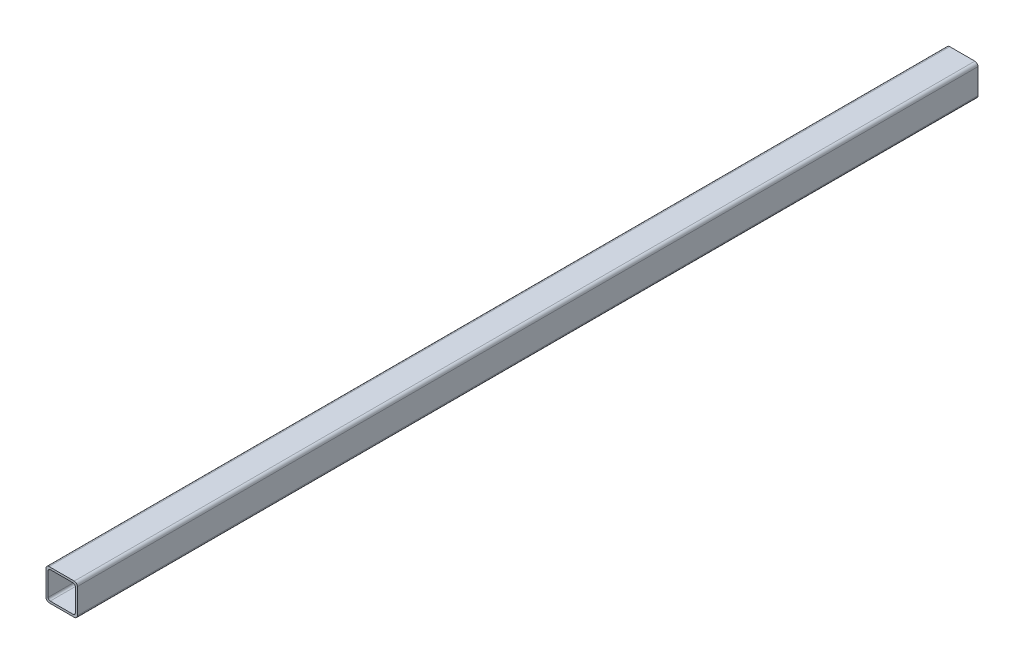
ISO-10303-21;
HEADER;
FILE_DESCRIPTION(('STEP AP214'),'2;1');
FILE_NAME('part.step','',(''),(''),'','','');
FILE_SCHEMA(('AUTOMOTIVE_DESIGN { 1 0 10303 214 1 1 1 1 }'));
ENDSEC;
DATA;
#1=APPLICATION_CONTEXT('core data for automotive mechanical design processes');
#2=APPLICATION_PROTOCOL_DEFINITION('international standard','automotive_design',2000,#1);
#3=PRODUCT_CONTEXT('',#1,'mechanical');
#4=PRODUCT('Part','Part','',(#3));
#5=PRODUCT_RELATED_PRODUCT_CATEGORY('part','',(#4));
#6=PRODUCT_DEFINITION_FORMATION('','',#4);
#7=PRODUCT_DEFINITION_CONTEXT('part definition',#1,'design');
#8=PRODUCT_DEFINITION('design','',#6,#7);
#9=PRODUCT_DEFINITION_SHAPE('','',#8);
#10=(LENGTH_UNIT() NAMED_UNIT(*) SI_UNIT(.MILLI.,.METRE.));
#11=(NAMED_UNIT(*) PLANE_ANGLE_UNIT() SI_UNIT($,.RADIAN.));
#12=(NAMED_UNIT(*) SI_UNIT($,.STERADIAN.) SOLID_ANGLE_UNIT());
#13=UNCERTAINTY_MEASURE_WITH_UNIT(LENGTH_MEASURE(1.E-05),#10,'distance_accuracy_value','');
#14=(GEOMETRIC_REPRESENTATION_CONTEXT(3) GLOBAL_UNCERTAINTY_ASSIGNED_CONTEXT((#13)) GLOBAL_UNIT_ASSIGNED_CONTEXT((#10,
#11,#12)) REPRESENTATION_CONTEXT('',''));
#15=CARTESIAN_POINT('',(0.,0.,0.));
#16=DIRECTION('',(0.,0.,1.));
#17=DIRECTION('',(1.,0.,0.));
#18=AXIS2_PLACEMENT_3D('',#15,#16,#17);
#19=CARTESIAN_POINT('',(-30.,-3.00000000000001,472.426406871193));
#20=DIRECTION('',(1.,0.,0.));
#21=DIRECTION('',(0.,0.,-1.));
#22=AXIS2_PLACEMENT_3D('',#19,#20,#21);
#23=PLANE('',#22);
#24=DIRECTION('',(0.,-1.,0.));
#25=VECTOR('',#24,1.);
#26=CARTESIAN_POINT('',(-30.,-3.00000000000001,430.));
#27=LINE('',#26,#25);
#28=CARTESIAN_POINT('',(-30.,-3.00000000000001,430.));
#29=VERTEX_POINT('',#28);
#30=CARTESIAN_POINT('',(-30.,-27.,430.));
#31=VERTEX_POINT('',#30);
#32=EDGE_CURVE('E196',#29,#31,#27,.T.);
#33=ORIENTED_EDGE('',*,*,#32,.F.);
#34=DIRECTION('',(0.,0.,-1.));
#35=VECTOR('',#34,1.);
#36=CARTESIAN_POINT('',(-30.,-3.00000000000001,472.426406871193));
#37=LINE('',#36,#35);
#38=CARTESIAN_POINT('',(-30.,-3.00000000000001,-430.));
#39=VERTEX_POINT('',#38);
#40=EDGE_CURVE('E49',#29,#39,#37,.T.);
#41=ORIENTED_EDGE('',*,*,#40,.T.);
#42=DIRECTION('',(0.,-1.,0.));
#43=VECTOR('',#42,1.);
#44=CARTESIAN_POINT('',(-30.,-3.00000000000001,-430.));
#45=LINE('',#44,#43);
#46=CARTESIAN_POINT('',(-30.,-27.,-430.));
#47=VERTEX_POINT('',#46);
#48=EDGE_CURVE('E272',#39,#47,#45,.T.);
#49=ORIENTED_EDGE('',*,*,#48,.T.);
#50=DIRECTION('',(0.,0.,-1.));
#51=VECTOR('',#50,1.);
#52=CARTESIAN_POINT('',(-30.,-27.,472.426406871193));
#53=LINE('',#52,#51);
#54=EDGE_CURVE('E232',#31,#47,#53,.T.);
#55=ORIENTED_EDGE('',*,*,#54,.F.);
#56=EDGE_LOOP('',(#33,#41,#49,#55));
#57=FACE_BOUND('',#56,.T.);
#58=ADVANCED_FACE('F34',(#57),#23,.F.);
#59=CARTESIAN_POINT('',(-27.,-2.99999999999999,472.426406871193));
#60=DIRECTION('',(0.,0.,-1.));
#61=DIRECTION('',(-1.,0.,0.));
#62=AXIS2_PLACEMENT_3D('',#59,#60,#61);
#63=CYLINDRICAL_SURFACE('',#62,3.);
#64=CARTESIAN_POINT('',(-27.,-2.99999999999999,430.));
#65=DIRECTION('',(0.,0.,1.));
#66=DIRECTION('',(0.,-1.,0.));
#67=AXIS2_PLACEMENT_3D('',#64,#65,#66);
#68=CIRCLE('',#67,3.);
#69=CARTESIAN_POINT('',(-27.,0.,430.));
#70=VERTEX_POINT('',#69);
#71=EDGE_CURVE('E199',#70,#29,#68,.T.);
#72=ORIENTED_EDGE('',*,*,#71,.F.);
#73=DIRECTION('',(0.,0.,-1.));
#74=VECTOR('',#73,1.);
#75=CARTESIAN_POINT('',(-27.,0.,472.426406871193));
#76=LINE('',#75,#74);
#77=CARTESIAN_POINT('',(-27.,0.,-430.));
#78=VERTEX_POINT('',#77);
#79=EDGE_CURVE('E235',#70,#78,#76,.T.);
#80=ORIENTED_EDGE('',*,*,#79,.T.);
#81=CARTESIAN_POINT('',(-27.,-2.99999999999999,-430.));
#82=DIRECTION('',(0.,0.,1.));
#83=DIRECTION('',(0.,-1.,0.));
#84=AXIS2_PLACEMENT_3D('',#81,#82,#83);
#85=CIRCLE('',#84,3.);
#86=EDGE_CURVE('E270',#78,#39,#85,.T.);
#87=ORIENTED_EDGE('',*,*,#86,.T.);
#88=ORIENTED_EDGE('',*,*,#40,.F.);
#89=EDGE_LOOP('',(#72,#80,#87,#88));
#90=FACE_BOUND('',#89,.T.);
#91=ADVANCED_FACE('F320',(#90),#63,.T.);
#92=CARTESIAN_POINT('',(-27.,0.,472.426406871193));
#93=DIRECTION('',(0.,-1.,0.));
#94=DIRECTION('',(0.,0.,-1.));
#95=AXIS2_PLACEMENT_3D('',#92,#93,#94);
#96=PLANE('',#95);
#97=DIRECTION('',(-1.,0.,0.));
#98=VECTOR('',#97,1.);
#99=CARTESIAN_POINT('',(-27.,0.,430.));
#100=LINE('',#99,#98);
#101=CARTESIAN_POINT('',(-3.00000000000001,0.,430.));
#102=VERTEX_POINT('',#101);
#103=EDGE_CURVE('E202',#102,#70,#100,.T.);
#104=ORIENTED_EDGE('',*,*,#103,.F.);
#105=DIRECTION('',(0.,0.,-1.));
#106=VECTOR('',#105,1.);
#107=CARTESIAN_POINT('',(-3.00000000000001,0.,472.426406871193));
#108=LINE('',#107,#106);
#109=CARTESIAN_POINT('',(-3.00000000000001,0.,-430.));
#110=VERTEX_POINT('',#109);
#111=EDGE_CURVE('E237',#102,#110,#108,.T.);
#112=ORIENTED_EDGE('',*,*,#111,.T.);
#113=DIRECTION('',(-1.,0.,0.));
#114=VECTOR('',#113,1.);
#115=CARTESIAN_POINT('',(-27.,0.,-430.));
#116=LINE('',#115,#114);
#117=EDGE_CURVE('E267',#110,#78,#116,.T.);
#118=ORIENTED_EDGE('',*,*,#117,.T.);
#119=ORIENTED_EDGE('',*,*,#79,.F.);
#120=EDGE_LOOP('',(#104,#112,#118,#119));
#121=FACE_BOUND('',#120,.T.);
#122=ADVANCED_FACE('F325',(#121),#96,.F.);
#123=CARTESIAN_POINT('',(-3.00000000000001,-2.99999999999999,472.426406871193));
#124=DIRECTION('',(0.,0.,-1.));
#125=DIRECTION('',(-1.,0.,0.));
#126=AXIS2_PLACEMENT_3D('',#123,#124,#125);
#127=CYLINDRICAL_SURFACE('',#126,3.);
#128=CARTESIAN_POINT('',(-3.00000000000001,-2.99999999999999,430.));
#129=DIRECTION('',(0.,0.,1.));
#130=DIRECTION('',(0.,-1.,0.));
#131=AXIS2_PLACEMENT_3D('',#128,#129,#130);
#132=CIRCLE('',#131,3.);
#133=CARTESIAN_POINT('',(0.,-2.99999999999999,430.));
#134=VERTEX_POINT('',#133);
#135=EDGE_CURVE('E205',#134,#102,#132,.T.);
#136=ORIENTED_EDGE('',*,*,#135,.F.);
#137=DIRECTION('',(0.,0.,-1.));
#138=VECTOR('',#137,1.);
#139=CARTESIAN_POINT('',(0.,-2.99999999999999,472.426406871193));
#140=LINE('',#139,#138);
#141=CARTESIAN_POINT('',(0.,-2.99999999999999,-430.));
#142=VERTEX_POINT('',#141);
#143=EDGE_CURVE('E239',#134,#142,#140,.T.);
#144=ORIENTED_EDGE('',*,*,#143,.T.);
#145=CARTESIAN_POINT('',(-3.00000000000001,-2.99999999999999,-430.));
#146=DIRECTION('',(0.,0.,1.));
#147=DIRECTION('',(0.,-1.,0.));
#148=AXIS2_PLACEMENT_3D('',#145,#146,#147);
#149=CIRCLE('',#148,3.);
#150=EDGE_CURVE('E264',#142,#110,#149,.T.);
#151=ORIENTED_EDGE('',*,*,#150,.T.);
#152=ORIENTED_EDGE('',*,*,#111,.F.);
#153=EDGE_LOOP('',(#136,#144,#151,#152));
#154=FACE_BOUND('',#153,.T.);
#155=ADVANCED_FACE('F330',(#154),#127,.T.);
#156=CARTESIAN_POINT('',(0.,-2.99999999999999,472.426406871193));
#157=DIRECTION('',(-1.,0.,0.));
#158=DIRECTION('',(0.,-1.,0.));
#159=AXIS2_PLACEMENT_3D('',#156,#157,#158);
#160=PLANE('',#159);
#161=DIRECTION('',(0.,1.,0.));
#162=VECTOR('',#161,1.);
#163=CARTESIAN_POINT('',(0.,-2.99999999999998,430.));
#164=LINE('',#163,#162);
#165=CARTESIAN_POINT('',(0.,-27.,430.));
#166=VERTEX_POINT('',#165);
#167=EDGE_CURVE('E208',#166,#134,#164,.T.);
#168=ORIENTED_EDGE('',*,*,#167,.F.);
#169=DIRECTION('',(0.,0.,-1.));
#170=VECTOR('',#169,1.);
#171=CARTESIAN_POINT('',(0.,-27.,472.426406871193));
#172=LINE('',#171,#170);
#173=CARTESIAN_POINT('',(0.,-27.,-430.));
#174=VERTEX_POINT('',#173);
#175=EDGE_CURVE('E241',#166,#174,#172,.T.);
#176=ORIENTED_EDGE('',*,*,#175,.T.);
#177=DIRECTION('',(0.,1.,0.));
#178=VECTOR('',#177,1.);
#179=CARTESIAN_POINT('',(0.,-2.99999999999998,-430.));
#180=LINE('',#179,#178);
#181=EDGE_CURVE('E259',#174,#142,#180,.T.);
#182=ORIENTED_EDGE('',*,*,#181,.T.);
#183=ORIENTED_EDGE('',*,*,#143,.F.);
#184=EDGE_LOOP('',(#168,#176,#182,#183));
#185=FACE_BOUND('',#184,.T.);
#186=ADVANCED_FACE('F334',(#185),#160,.F.);
#187=CARTESIAN_POINT('',(-3.,-27.,472.426406871193));
#188=DIRECTION('',(0.,0.,-1.));
#189=DIRECTION('',(-1.,0.,0.));
#190=AXIS2_PLACEMENT_3D('',#187,#188,#189);
#191=CYLINDRICAL_SURFACE('',#190,3.);
#192=CARTESIAN_POINT('',(-3.,-27.,430.));
#193=DIRECTION('',(0.,0.,1.));
#194=DIRECTION('',(0.,-1.,0.));
#195=AXIS2_PLACEMENT_3D('',#192,#193,#194);
#196=CIRCLE('',#195,3.);
#197=CARTESIAN_POINT('',(-3.,-30.,430.));
#198=VERTEX_POINT('',#197);
#199=EDGE_CURVE('E211',#198,#166,#196,.T.);
#200=ORIENTED_EDGE('',*,*,#199,.F.);
#201=DIRECTION('',(0.,0.,-1.));
#202=VECTOR('',#201,1.);
#203=CARTESIAN_POINT('',(-3.,-30.,472.426406871193));
#204=LINE('',#203,#202);
#205=CARTESIAN_POINT('',(-3.,-30.,-430.));
#206=VERTEX_POINT('',#205);
#207=EDGE_CURVE('E243',#198,#206,#204,.T.);
#208=ORIENTED_EDGE('',*,*,#207,.T.);
#209=CARTESIAN_POINT('',(-3.,-27.,-430.));
#210=DIRECTION('',(0.,0.,1.));
#211=DIRECTION('',(0.,-1.,0.));
#212=AXIS2_PLACEMENT_3D('',#209,#210,#211);
#213=CIRCLE('',#212,3.);
#214=EDGE_CURVE('E258',#206,#174,#213,.T.);
#215=ORIENTED_EDGE('',*,*,#214,.T.);
#216=ORIENTED_EDGE('',*,*,#175,.F.);
#217=EDGE_LOOP('',(#200,#208,#215,#216));
#218=FACE_BOUND('',#217,.T.);
#219=ADVANCED_FACE('F338',(#218),#191,.T.);
#220=CARTESIAN_POINT('',(-27.,-30.,472.426406871193));
#221=DIRECTION('',(0.,1.,0.));
#222=DIRECTION('',(-1.,0.,0.));
#223=AXIS2_PLACEMENT_3D('',#220,#221,#222);
#224=PLANE('',#223);
#225=DIRECTION('',(1.,0.,0.));
#226=VECTOR('',#225,1.);
#227=CARTESIAN_POINT('',(-27.,-30.,430.));
#228=LINE('',#227,#226);
#229=CARTESIAN_POINT('',(-27.,-30.,430.));
#230=VERTEX_POINT('',#229);
#231=EDGE_CURVE('E214',#230,#198,#228,.T.);
#232=ORIENTED_EDGE('',*,*,#231,.F.);
#233=DIRECTION('',(0.,0.,-1.));
#234=VECTOR('',#233,1.);
#235=CARTESIAN_POINT('',(-27.,-30.,472.426406871193));
#236=LINE('',#235,#234);
#237=CARTESIAN_POINT('',(-27.,-30.,-430.));
#238=VERTEX_POINT('',#237);
#239=EDGE_CURVE('E42',#230,#238,#236,.T.);
#240=ORIENTED_EDGE('',*,*,#239,.T.);
#241=DIRECTION('',(1.,0.,0.));
#242=VECTOR('',#241,1.);
#243=CARTESIAN_POINT('',(-27.,-30.,-430.));
#244=LINE('',#243,#242);
#245=EDGE_CURVE('E177',#238,#206,#244,.T.);
#246=ORIENTED_EDGE('',*,*,#245,.T.);
#247=ORIENTED_EDGE('',*,*,#207,.F.);
#248=EDGE_LOOP('',(#232,#240,#246,#247));
#249=FACE_BOUND('',#248,.T.);
#250=ADVANCED_FACE('F247',(#249),#224,.F.);
#251=CARTESIAN_POINT('',(-27.,-27.,472.426406871193));
#252=DIRECTION('',(0.,0.,-1.));
#253=DIRECTION('',(-1.,0.,0.));
#254=AXIS2_PLACEMENT_3D('',#251,#252,#253);
#255=CYLINDRICAL_SURFACE('',#254,3.);
#256=CARTESIAN_POINT('',(-27.,-27.,430.));
#257=DIRECTION('',(0.,0.,1.));
#258=DIRECTION('',(0.,-1.,0.));
#259=AXIS2_PLACEMENT_3D('',#256,#257,#258);
#260=CIRCLE('',#259,3.);
#261=EDGE_CURVE('E217',#31,#230,#260,.T.);
#262=ORIENTED_EDGE('',*,*,#261,.F.);
#263=ORIENTED_EDGE('',*,*,#54,.T.);
#264=CARTESIAN_POINT('',(-27.,-27.,-430.));
#265=DIRECTION('',(0.,0.,1.));
#266=DIRECTION('',(0.,-1.,0.));
#267=AXIS2_PLACEMENT_3D('',#264,#265,#266);
#268=CIRCLE('',#267,3.);
#269=EDGE_CURVE('E172',#47,#238,#268,.T.);
#270=ORIENTED_EDGE('',*,*,#269,.T.);
#271=ORIENTED_EDGE('',*,*,#239,.F.);
#272=EDGE_LOOP('',(#262,#263,#270,#271));
#273=FACE_BOUND('',#272,.T.);
#274=ADVANCED_FACE('F36',(#273),#255,.T.);
#275=CARTESIAN_POINT('',(-28.,-4.00000000000001,472.426406871193));
#276=DIRECTION('',(1.,0.,0.));
#277=DIRECTION('',(0.,0.,-1.));
#278=AXIS2_PLACEMENT_3D('',#275,#276,#277);
#279=PLANE('',#278);
#280=DIRECTION('',(0.,0.,-1.));
#281=VECTOR('',#280,1.);
#282=CARTESIAN_POINT('',(-28.,-4.00000000000001,472.426406871193));
#283=LINE('',#282,#281);
#284=CARTESIAN_POINT('',(-28.,-4.00000000000001,430.));
#285=VERTEX_POINT('',#284);
#286=CARTESIAN_POINT('',(-28.,-4.00000000000001,-430.));
#287=VERTEX_POINT('',#286);
#288=EDGE_CURVE('E148',#285,#287,#283,.T.);
#289=ORIENTED_EDGE('',*,*,#288,.F.);
#290=DIRECTION('',(0.,-1.,0.));
#291=VECTOR('',#290,1.);
#292=CARTESIAN_POINT('',(-28.,-4.,430.));
#293=LINE('',#292,#291);
#294=CARTESIAN_POINT('',(-28.,-26.,430.));
#295=VERTEX_POINT('',#294);
#296=EDGE_CURVE('E11',#285,#295,#293,.T.);
#297=ORIENTED_EDGE('',*,*,#296,.T.);
#298=DIRECTION('',(0.,0.,-1.));
#299=VECTOR('',#298,1.);
#300=CARTESIAN_POINT('',(-28.,-26.,472.426406871193));
#301=LINE('',#300,#299);
#302=CARTESIAN_POINT('',(-28.,-26.,-430.));
#303=VERTEX_POINT('',#302);
#304=EDGE_CURVE('E157',#295,#303,#301,.T.);
#305=ORIENTED_EDGE('',*,*,#304,.T.);
#306=DIRECTION('',(0.,-1.,0.));
#307=VECTOR('',#306,1.);
#308=CARTESIAN_POINT('',(-28.,-4.,-430.));
#309=LINE('',#308,#307);
#310=EDGE_CURVE('E165',#287,#303,#309,.T.);
#311=ORIENTED_EDGE('',*,*,#310,.F.);
#312=EDGE_LOOP('',(#289,#297,#305,#311));
#313=FACE_BOUND('',#312,.T.);
#314=ADVANCED_FACE('F170',(#313),#279,.T.);
#315=CARTESIAN_POINT('',(-26.,-3.99999999999999,472.426406871193));
#316=DIRECTION('',(0.,0.,-1.));
#317=DIRECTION('',(-1.,0.,0.));
#318=AXIS2_PLACEMENT_3D('',#315,#316,#317);
#319=CYLINDRICAL_SURFACE('',#318,2.);
#320=DIRECTION('',(0.,0.,-1.));
#321=VECTOR('',#320,1.);
#322=CARTESIAN_POINT('',(-26.,-1.99999999999999,472.426406871193));
#323=LINE('',#322,#321);
#324=CARTESIAN_POINT('',(-26.,-1.99999999999999,430.));
#325=VERTEX_POINT('',#324);
#326=CARTESIAN_POINT('',(-26.,-1.99999999999999,-430.));
#327=VERTEX_POINT('',#326);
#328=EDGE_CURVE('E156',#325,#327,#323,.T.);
#329=ORIENTED_EDGE('',*,*,#328,.F.);
#330=CARTESIAN_POINT('',(-26.,-3.99999999999999,430.));
#331=DIRECTION('',(0.,0.,1.));
#332=DIRECTION('',(0.,-1.,0.));
#333=AXIS2_PLACEMENT_3D('',#330,#331,#332);
#334=CIRCLE('',#333,2.);
#335=EDGE_CURVE('E153',#325,#285,#334,.T.);
#336=ORIENTED_EDGE('',*,*,#335,.T.);
#337=ORIENTED_EDGE('',*,*,#288,.T.);
#338=CARTESIAN_POINT('',(-26.,-3.99999999999999,-430.));
#339=DIRECTION('',(0.,0.,1.));
#340=DIRECTION('',(0.,-1.,0.));
#341=AXIS2_PLACEMENT_3D('',#338,#339,#340);
#342=CIRCLE('',#341,2.);
#343=EDGE_CURVE('E152',#327,#287,#342,.T.);
#344=ORIENTED_EDGE('',*,*,#343,.F.);
#345=EDGE_LOOP('',(#329,#336,#337,#344));
#346=FACE_BOUND('',#345,.T.);
#347=ADVANCED_FACE('F151',(#346),#319,.F.);
#348=CARTESIAN_POINT('',(-26.,-1.99999999999999,472.426406871193));
#349=DIRECTION('',(0.,-1.,0.));
#350=DIRECTION('',(0.,0.,-1.));
#351=AXIS2_PLACEMENT_3D('',#348,#349,#350);
#352=PLANE('',#351);
#353=DIRECTION('',(0.,0.,-1.));
#354=VECTOR('',#353,1.);
#355=CARTESIAN_POINT('',(-4.00000000000002,-1.99999999999999,472.426406871193));
#356=LINE('',#355,#354);
#357=CARTESIAN_POINT('',(-4.00000000000002,-1.99999999999999,430.));
#358=VERTEX_POINT('',#357);
#359=CARTESIAN_POINT('',(-4.00000000000002,-1.99999999999999,-430.));
#360=VERTEX_POINT('',#359);
#361=EDGE_CURVE('E222',#358,#360,#356,.T.);
#362=ORIENTED_EDGE('',*,*,#361,.F.);
#363=DIRECTION('',(-1.,0.,0.));
#364=VECTOR('',#363,1.);
#365=CARTESIAN_POINT('',(-26.,-1.99999999999999,430.));
#366=LINE('',#365,#364);
#367=EDGE_CURVE('E174',#358,#325,#366,.T.);
#368=ORIENTED_EDGE('',*,*,#367,.T.);
#369=ORIENTED_EDGE('',*,*,#328,.T.);
#370=DIRECTION('',(-1.,0.,0.));
#371=VECTOR('',#370,1.);
#372=CARTESIAN_POINT('',(-26.,-1.99999999999999,-430.));
#373=LINE('',#372,#371);
#374=EDGE_CURVE('E168',#360,#327,#373,.T.);
#375=ORIENTED_EDGE('',*,*,#374,.F.);
#376=EDGE_LOOP('',(#362,#368,#369,#375));
#377=FACE_BOUND('',#376,.T.);
#378=ADVANCED_FACE('F293',(#377),#352,.T.);
#379=CARTESIAN_POINT('',(-4.00000000000001,-3.99999999999999,472.426406871193));
#380=DIRECTION('',(0.,0.,-1.));
#381=DIRECTION('',(-1.,0.,0.));
#382=AXIS2_PLACEMENT_3D('',#379,#380,#381);
#383=CYLINDRICAL_SURFACE('',#382,2.);
#384=DIRECTION('',(0.,0.,-1.));
#385=VECTOR('',#384,1.);
#386=CARTESIAN_POINT('',(-2.00000000000001,-4.,472.426406871193));
#387=LINE('',#386,#385);
#388=CARTESIAN_POINT('',(-2.00000000000001,-4.,430.));
#389=VERTEX_POINT('',#388);
#390=CARTESIAN_POINT('',(-2.00000000000001,-4.,-430.));
#391=VERTEX_POINT('',#390);
#392=EDGE_CURVE('E224',#389,#391,#387,.T.);
#393=ORIENTED_EDGE('',*,*,#392,.F.);
#394=CARTESIAN_POINT('',(-4.00000000000001,-3.99999999999999,430.));
#395=DIRECTION('',(0.,0.,1.));
#396=DIRECTION('',(0.,-1.,0.));
#397=AXIS2_PLACEMENT_3D('',#394,#395,#396);
#398=CIRCLE('',#397,2.);
#399=EDGE_CURVE('E183',#389,#358,#398,.T.);
#400=ORIENTED_EDGE('',*,*,#399,.T.);
#401=ORIENTED_EDGE('',*,*,#361,.T.);
#402=CARTESIAN_POINT('',(-4.00000000000001,-3.99999999999999,-430.));
#403=DIRECTION('',(0.,0.,1.));
#404=DIRECTION('',(0.,-1.,0.));
#405=AXIS2_PLACEMENT_3D('',#402,#403,#404);
#406=CIRCLE('',#405,2.);
#407=EDGE_CURVE('E285',#391,#360,#406,.T.);
#408=ORIENTED_EDGE('',*,*,#407,.F.);
#409=EDGE_LOOP('',(#393,#400,#401,#408));
#410=FACE_BOUND('',#409,.T.);
#411=ADVANCED_FACE('F297',(#410),#383,.F.);
#412=CARTESIAN_POINT('',(-2.00000000000001,-4.00000000000001,472.426406871193));
#413=DIRECTION('',(-1.,0.,0.));
#414=DIRECTION('',(0.,0.,1.));
#415=AXIS2_PLACEMENT_3D('',#412,#413,#414);
#416=PLANE('',#415);
#417=DIRECTION('',(0.,0.,-1.));
#418=VECTOR('',#417,1.);
#419=CARTESIAN_POINT('',(-2.00000000000001,-26.,472.426406871193));
#420=LINE('',#419,#418);
#421=CARTESIAN_POINT('',(-2.00000000000001,-26.,430.));
#422=VERTEX_POINT('',#421);
#423=CARTESIAN_POINT('',(-2.00000000000001,-26.,-430.));
#424=VERTEX_POINT('',#423);
#425=EDGE_CURVE('E226',#422,#424,#420,.T.);
#426=ORIENTED_EDGE('',*,*,#425,.F.);
#427=DIRECTION('',(0.,1.,0.));
#428=VECTOR('',#427,1.);
#429=CARTESIAN_POINT('',(-2.00000000000001,-4.,430.));
#430=LINE('',#429,#428);
#431=EDGE_CURVE('E186',#422,#389,#430,.T.);
#432=ORIENTED_EDGE('',*,*,#431,.T.);
#433=ORIENTED_EDGE('',*,*,#392,.T.);
#434=DIRECTION('',(0.,1.,0.));
#435=VECTOR('',#434,1.);
#436=CARTESIAN_POINT('',(-2.00000000000001,-4.,-430.));
#437=LINE('',#436,#435);
#438=EDGE_CURVE('E282',#424,#391,#437,.T.);
#439=ORIENTED_EDGE('',*,*,#438,.F.);
#440=EDGE_LOOP('',(#426,#432,#433,#439));
#441=FACE_BOUND('',#440,.T.);
#442=ADVANCED_FACE('F299',(#441),#416,.T.);
#443=CARTESIAN_POINT('',(-4.00000000000001,-26.,472.426406871193));
#444=DIRECTION('',(0.,0.,-1.));
#445=DIRECTION('',(-1.,0.,0.));
#446=AXIS2_PLACEMENT_3D('',#443,#444,#445);
#447=CYLINDRICAL_SURFACE('',#446,2.);
#448=DIRECTION('',(0.,0.,-1.));
#449=VECTOR('',#448,1.);
#450=CARTESIAN_POINT('',(-4.00000000000002,-28.,472.426406871193));
#451=LINE('',#450,#449);
#452=CARTESIAN_POINT('',(-4.00000000000001,-28.,430.));
#453=VERTEX_POINT('',#452);
#454=CARTESIAN_POINT('',(-4.00000000000001,-28.,-430.));
#455=VERTEX_POINT('',#454);
#456=EDGE_CURVE('E228',#453,#455,#451,.T.);
#457=ORIENTED_EDGE('',*,*,#456,.F.);
#458=CARTESIAN_POINT('',(-4.00000000000001,-26.,430.));
#459=DIRECTION('',(0.,0.,1.));
#460=DIRECTION('',(0.,-1.,0.));
#461=AXIS2_PLACEMENT_3D('',#458,#459,#460);
#462=CIRCLE('',#461,2.);
#463=EDGE_CURVE('E189',#453,#422,#462,.T.);
#464=ORIENTED_EDGE('',*,*,#463,.T.);
#465=ORIENTED_EDGE('',*,*,#425,.T.);
#466=CARTESIAN_POINT('',(-4.00000000000001,-26.,-430.));
#467=DIRECTION('',(0.,0.,1.));
#468=DIRECTION('',(0.,-1.,0.));
#469=AXIS2_PLACEMENT_3D('',#466,#467,#468);
#470=CIRCLE('',#469,2.);
#471=EDGE_CURVE('E279',#455,#424,#470,.T.);
#472=ORIENTED_EDGE('',*,*,#471,.F.);
#473=EDGE_LOOP('',(#457,#464,#465,#472));
#474=FACE_BOUND('',#473,.T.);
#475=ADVANCED_FACE('F303',(#474),#447,.F.);
#476=CARTESIAN_POINT('',(-26.,-28.,472.426406871193));
#477=DIRECTION('',(0.,1.,0.));
#478=DIRECTION('',(0.,0.,1.));
#479=AXIS2_PLACEMENT_3D('',#476,#477,#478);
#480=PLANE('',#479);
#481=DIRECTION('',(0.,0.,-1.));
#482=VECTOR('',#481,1.);
#483=CARTESIAN_POINT('',(-26.,-28.,472.426406871193));
#484=LINE('',#483,#482);
#485=CARTESIAN_POINT('',(-26.,-28.,430.));
#486=VERTEX_POINT('',#485);
#487=CARTESIAN_POINT('',(-26.,-28.,-430.));
#488=VERTEX_POINT('',#487);
#489=EDGE_CURVE('E230',#486,#488,#484,.T.);
#490=ORIENTED_EDGE('',*,*,#489,.F.);
#491=DIRECTION('',(1.,0.,0.));
#492=VECTOR('',#491,1.);
#493=CARTESIAN_POINT('',(-26.,-28.,430.));
#494=LINE('',#493,#492);
#495=EDGE_CURVE('E192',#486,#453,#494,.T.);
#496=ORIENTED_EDGE('',*,*,#495,.T.);
#497=ORIENTED_EDGE('',*,*,#456,.T.);
#498=DIRECTION('',(1.,0.,0.));
#499=VECTOR('',#498,1.);
#500=CARTESIAN_POINT('',(-26.,-28.,-430.));
#501=LINE('',#500,#499);
#502=EDGE_CURVE('E276',#488,#455,#501,.T.);
#503=ORIENTED_EDGE('',*,*,#502,.F.);
#504=EDGE_LOOP('',(#490,#496,#497,#503));
#505=FACE_BOUND('',#504,.T.);
#506=ADVANCED_FACE('F307',(#505),#480,.T.);
#507=CARTESIAN_POINT('',(-26.,-26.,472.426406871193));
#508=DIRECTION('',(0.,0.,-1.));
#509=DIRECTION('',(-1.,0.,0.));
#510=AXIS2_PLACEMENT_3D('',#507,#508,#509);
#511=CYLINDRICAL_SURFACE('',#510,2.);
#512=ORIENTED_EDGE('',*,*,#304,.F.);
#513=CARTESIAN_POINT('',(-26.,-26.,430.));
#514=DIRECTION('',(0.,0.,1.));
#515=DIRECTION('',(0.,-1.,0.));
#516=AXIS2_PLACEMENT_3D('',#513,#514,#515);
#517=CIRCLE('',#516,2.);
#518=EDGE_CURVE('E57',#295,#486,#517,.T.);
#519=ORIENTED_EDGE('',*,*,#518,.T.);
#520=ORIENTED_EDGE('',*,*,#489,.T.);
#521=CARTESIAN_POINT('',(-26.,-26.,-430.));
#522=DIRECTION('',(0.,0.,1.));
#523=DIRECTION('',(0.,-1.,0.));
#524=AXIS2_PLACEMENT_3D('',#521,#522,#523);
#525=CIRCLE('',#524,2.);
#526=EDGE_CURVE('E274',#303,#488,#525,.T.);
#527=ORIENTED_EDGE('',*,*,#526,.F.);
#528=EDGE_LOOP('',(#512,#519,#520,#527));
#529=FACE_BOUND('',#528,.T.);
#530=ADVANCED_FACE('F309',(#529),#511,.F.);
#531=CARTESIAN_POINT('',(-233.,38.5,430.));
#532=DIRECTION('',(0.,0.,1.));
#533=DIRECTION('',(0.,-1.,0.));
#534=AXIS2_PLACEMENT_3D('',#531,#532,#533);
#535=PLANE('',#534);
#536=ORIENTED_EDGE('',*,*,#518,.F.);
#537=ORIENTED_EDGE('',*,*,#296,.F.);
#538=ORIENTED_EDGE('',*,*,#335,.F.);
#539=ORIENTED_EDGE('',*,*,#367,.F.);
#540=ORIENTED_EDGE('',*,*,#399,.F.);
#541=ORIENTED_EDGE('',*,*,#431,.F.);
#542=ORIENTED_EDGE('',*,*,#463,.F.);
#543=ORIENTED_EDGE('',*,*,#495,.F.);
#544=EDGE_LOOP('',(#536,#537,#538,#539,#540,#541,#542,#543));
#545=FACE_BOUND('',#544,.T.);
#546=ORIENTED_EDGE('',*,*,#32,.T.);
#547=ORIENTED_EDGE('',*,*,#261,.T.);
#548=ORIENTED_EDGE('',*,*,#231,.T.);
#549=ORIENTED_EDGE('',*,*,#199,.T.);
#550=ORIENTED_EDGE('',*,*,#167,.T.);
#551=ORIENTED_EDGE('',*,*,#135,.T.);
#552=ORIENTED_EDGE('',*,*,#103,.T.);
#553=ORIENTED_EDGE('',*,*,#71,.T.);
#554=EDGE_LOOP('',(#546,#547,#548,#549,#550,#551,#552,#553));
#555=FACE_BOUND('',#554,.T.);
#556=ADVANCED_FACE('F294',(#545,#555),#535,.T.);
#557=CARTESIAN_POINT('',(-233.,38.5,-430.));
#558=DIRECTION('',(0.,0.,-1.));
#559=DIRECTION('',(0.,-1.,0.));
#560=AXIS2_PLACEMENT_3D('',#557,#558,#559);
#561=PLANE('',#560);
#562=ORIENTED_EDGE('',*,*,#526,.T.);
#563=ORIENTED_EDGE('',*,*,#502,.T.);
#564=ORIENTED_EDGE('',*,*,#471,.T.);
#565=ORIENTED_EDGE('',*,*,#438,.T.);
#566=ORIENTED_EDGE('',*,*,#407,.T.);
#567=ORIENTED_EDGE('',*,*,#374,.T.);
#568=ORIENTED_EDGE('',*,*,#343,.T.);
#569=ORIENTED_EDGE('',*,*,#310,.T.);
#570=EDGE_LOOP('',(#562,#563,#564,#565,#566,#567,#568,#569));
#571=FACE_BOUND('',#570,.T.);
#572=ORIENTED_EDGE('',*,*,#48,.F.);
#573=ORIENTED_EDGE('',*,*,#86,.F.);
#574=ORIENTED_EDGE('',*,*,#117,.F.);
#575=ORIENTED_EDGE('',*,*,#150,.F.);
#576=ORIENTED_EDGE('',*,*,#181,.F.);
#577=ORIENTED_EDGE('',*,*,#214,.F.);
#578=ORIENTED_EDGE('',*,*,#245,.F.);
#579=ORIENTED_EDGE('',*,*,#269,.F.);
#580=EDGE_LOOP('',(#572,#573,#574,#575,#576,#577,#578,#579));
#581=FACE_BOUND('',#580,.T.);
#582=ADVANCED_FACE('F163',(#571,#581),#561,.T.);
#583=CLOSED_SHELL('',(#58,#91,#122,#155,#186,#219,#250,#274,#314,#347,#378,#411,#442,#475,#506,
#530,#556,#582));
#584=MANIFOLD_SOLID_BREP('B2',#583);
#585=ADVANCED_BREP_SHAPE_REPRESENTATION('',(#18,#584),#14);
#586=SHAPE_DEFINITION_REPRESENTATION(#9,#585);
ENDSEC;
END-ISO-10303-21;
